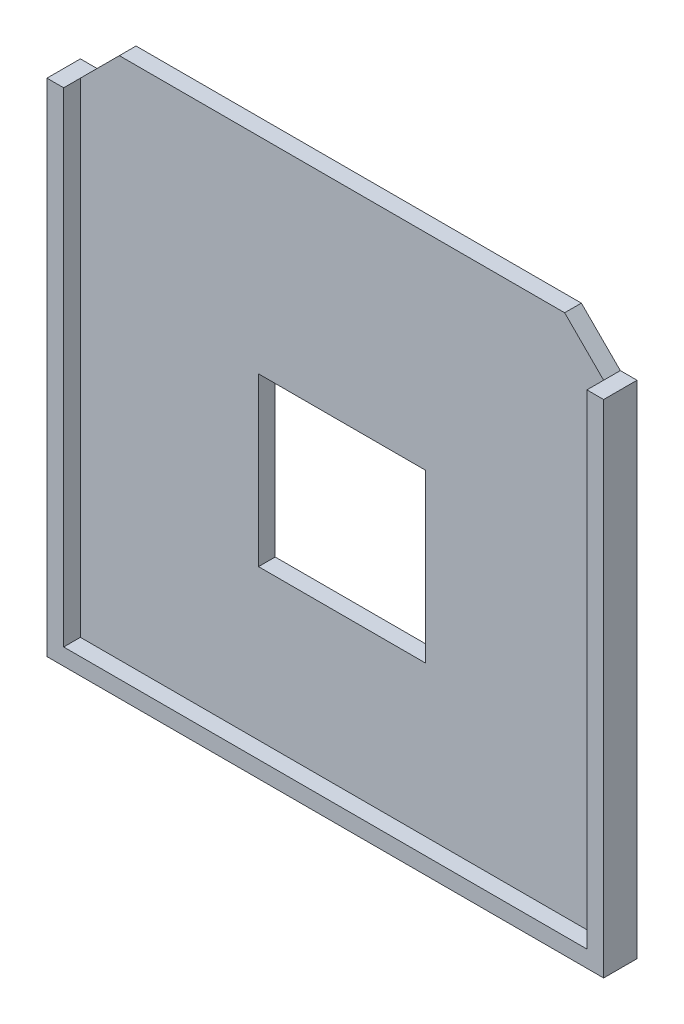
ISO-10303-21;
HEADER;
FILE_DESCRIPTION(('STEP AP214'),'2;1');
FILE_NAME('part.step','',(''),(''),'','','');
FILE_SCHEMA(('AUTOMOTIVE_DESIGN { 1 0 10303 214 1 1 1 1 }'));
ENDSEC;
DATA;
#1=APPLICATION_CONTEXT('core data for automotive mechanical design processes');
#2=APPLICATION_PROTOCOL_DEFINITION('international standard','automotive_design',2000,#1);
#3=PRODUCT_CONTEXT('',#1,'mechanical');
#4=PRODUCT('Part','Part','',(#3));
#5=PRODUCT_RELATED_PRODUCT_CATEGORY('part','',(#4));
#6=PRODUCT_DEFINITION_FORMATION('','',#4);
#7=PRODUCT_DEFINITION_CONTEXT('part definition',#1,'design');
#8=PRODUCT_DEFINITION('design','',#6,#7);
#9=PRODUCT_DEFINITION_SHAPE('','',#8);
#10=(LENGTH_UNIT() NAMED_UNIT(*) SI_UNIT(.MILLI.,.METRE.));
#11=(NAMED_UNIT(*) PLANE_ANGLE_UNIT() SI_UNIT($,.RADIAN.));
#12=(NAMED_UNIT(*) SI_UNIT($,.STERADIAN.) SOLID_ANGLE_UNIT());
#13=UNCERTAINTY_MEASURE_WITH_UNIT(LENGTH_MEASURE(1.E-05),#10,'distance_accuracy_value','');
#14=(GEOMETRIC_REPRESENTATION_CONTEXT(3) GLOBAL_UNCERTAINTY_ASSIGNED_CONTEXT((#13)) GLOBAL_UNIT_ASSIGNED_CONTEXT((#10,
#11,#12)) REPRESENTATION_CONTEXT('',''));
#15=CARTESIAN_POINT('',(0.,0.,0.));
#16=DIRECTION('',(0.,0.,1.));
#17=DIRECTION('',(1.,0.,0.));
#18=AXIS2_PLACEMENT_3D('',#15,#16,#17);
#19=CARTESIAN_POINT('',(47.,45.,3.));
#20=DIRECTION('',(0.,-1.,0.));
#21=DIRECTION('',(0.,0.,-1.));
#22=AXIS2_PLACEMENT_3D('',#19,#20,#21);
#23=PLANE('',#22);
#24=DIRECTION('',(-1.,0.,0.));
#25=VECTOR('',#24,1.);
#26=CARTESIAN_POINT('',(47.,45.,0.));
#27=LINE('',#26,#25);
#28=CARTESIAN_POINT('',(50.,45.,0.));
#29=VERTEX_POINT('',#28);
#30=CARTESIAN_POINT('',(47.,45.,0.));
#31=VERTEX_POINT('',#30);
#32=EDGE_CURVE('E252',#29,#31,#27,.T.);
#33=ORIENTED_EDGE('',*,*,#32,.T.);
#34=DIRECTION('',(0.,0.,-1.));
#35=VECTOR('',#34,1.);
#36=CARTESIAN_POINT('',(47.,45.,3.));
#37=LINE('',#36,#35);
#38=CARTESIAN_POINT('',(47.,45.,3.));
#39=VERTEX_POINT('',#38);
#40=EDGE_CURVE('E11',#39,#31,#37,.T.);
#41=ORIENTED_EDGE('',*,*,#40,.F.);
#42=DIRECTION('',(0.,0.,-1.));
#43=VECTOR('',#42,1.);
#44=CARTESIAN_POINT('',(47.,45.,6.));
#45=LINE('',#44,#43);
#46=CARTESIAN_POINT('',(47.,45.,6.));
#47=VERTEX_POINT('',#46);
#48=EDGE_CURVE('E214',#47,#39,#45,.T.);
#49=ORIENTED_EDGE('',*,*,#48,.F.);
#50=DIRECTION('',(-1.,0.,0.));
#51=VECTOR('',#50,1.);
#52=CARTESIAN_POINT('',(47.,45.,6.));
#53=LINE('',#52,#51);
#54=CARTESIAN_POINT('',(50.,45.,6.));
#55=VERTEX_POINT('',#54);
#56=EDGE_CURVE('E182',#55,#47,#53,.T.);
#57=ORIENTED_EDGE('',*,*,#56,.F.);
#58=DIRECTION('',(0.,0.,-1.));
#59=VECTOR('',#58,1.);
#60=CARTESIAN_POINT('',(50.,45.,3.));
#61=LINE('',#60,#59);
#62=EDGE_CURVE('E271',#55,#29,#61,.T.);
#63=ORIENTED_EDGE('',*,*,#62,.T.);
#64=EDGE_LOOP('',(#33,#41,#49,#57,#63));
#65=FACE_BOUND('',#64,.T.);
#66=ADVANCED_FACE('F39',(#65),#23,.F.);
#67=CARTESIAN_POINT('',(40.,52.,3.));
#68=DIRECTION('',(-0.707106781186549,-0.707106781186546,0.));
#69=DIRECTION('',(0.707106781186546,-0.707106781186549,0.));
#70=AXIS2_PLACEMENT_3D('',#67,#68,#69);
#71=PLANE('',#70);
#72=DIRECTION('',(-0.707106781186546,0.707106781186549,0.));
#73=VECTOR('',#72,1.);
#74=CARTESIAN_POINT('',(40.,52.,0.));
#75=LINE('',#74,#73);
#76=CARTESIAN_POINT('',(40.,52.,0.));
#77=VERTEX_POINT('',#76);
#78=EDGE_CURVE('E275',#31,#77,#75,.T.);
#79=ORIENTED_EDGE('',*,*,#78,.T.);
#80=DIRECTION('',(0.,0.,-1.));
#81=VECTOR('',#80,1.);
#82=CARTESIAN_POINT('',(40.,52.,3.));
#83=LINE('',#82,#81);
#84=CARTESIAN_POINT('',(40.,52.,3.));
#85=VERTEX_POINT('',#84);
#86=EDGE_CURVE('E47',#85,#77,#83,.T.);
#87=ORIENTED_EDGE('',*,*,#86,.F.);
#88=DIRECTION('',(-0.707106781186546,0.707106781186549,0.));
#89=VECTOR('',#88,1.);
#90=CARTESIAN_POINT('',(40.,52.,3.));
#91=LINE('',#90,#89);
#92=EDGE_CURVE('E261',#39,#85,#91,.T.);
#93=ORIENTED_EDGE('',*,*,#92,.F.);
#94=ORIENTED_EDGE('',*,*,#40,.T.);
#95=EDGE_LOOP('',(#79,#87,#93,#94));
#96=FACE_BOUND('',#95,.T.);
#97=ADVANCED_FACE('F347',(#96),#71,.F.);
#98=CARTESIAN_POINT('',(-40.,52.,3.));
#99=DIRECTION('',(0.,-1.,0.));
#100=DIRECTION('',(0.,0.,-1.));
#101=AXIS2_PLACEMENT_3D('',#98,#99,#100);
#102=PLANE('',#101);
#103=DIRECTION('',(-1.,0.,0.));
#104=VECTOR('',#103,1.);
#105=CARTESIAN_POINT('',(-40.,52.,0.));
#106=LINE('',#105,#104);
#107=CARTESIAN_POINT('',(-40.,52.,0.));
#108=VERTEX_POINT('',#107);
#109=EDGE_CURVE('E278',#77,#108,#106,.T.);
#110=ORIENTED_EDGE('',*,*,#109,.T.);
#111=DIRECTION('',(0.,0.,-1.));
#112=VECTOR('',#111,1.);
#113=CARTESIAN_POINT('',(-40.,52.,3.));
#114=LINE('',#113,#112);
#115=CARTESIAN_POINT('',(-40.,52.,3.));
#116=VERTEX_POINT('',#115);
#117=EDGE_CURVE('E305',#116,#108,#114,.T.);
#118=ORIENTED_EDGE('',*,*,#117,.F.);
#119=DIRECTION('',(-1.,0.,0.));
#120=VECTOR('',#119,1.);
#121=CARTESIAN_POINT('',(-40.,52.,3.));
#122=LINE('',#121,#120);
#123=EDGE_CURVE('E264',#85,#116,#122,.T.);
#124=ORIENTED_EDGE('',*,*,#123,.F.);
#125=ORIENTED_EDGE('',*,*,#86,.T.);
#126=EDGE_LOOP('',(#110,#118,#124,#125));
#127=FACE_BOUND('',#126,.T.);
#128=ADVANCED_FACE('F314',(#127),#102,.F.);
#129=CARTESIAN_POINT('',(-47.,45.,3.));
#130=DIRECTION('',(0.707106781186549,-0.707106781186546,0.));
#131=DIRECTION('',(0.707106781186546,0.707106781186549,0.));
#132=AXIS2_PLACEMENT_3D('',#129,#130,#131);
#133=PLANE('',#132);
#134=DIRECTION('',(-0.707106781186546,-0.707106781186549,0.));
#135=VECTOR('',#134,1.);
#136=CARTESIAN_POINT('',(-47.,45.,0.));
#137=LINE('',#136,#135);
#138=CARTESIAN_POINT('',(-47.,45.,0.));
#139=VERTEX_POINT('',#138);
#140=EDGE_CURVE('E281',#108,#139,#137,.T.);
#141=ORIENTED_EDGE('',*,*,#140,.T.);
#142=DIRECTION('',(0.,0.,-1.));
#143=VECTOR('',#142,1.);
#144=CARTESIAN_POINT('',(-47.,45.,3.));
#145=LINE('',#144,#143);
#146=CARTESIAN_POINT('',(-47.,45.,3.));
#147=VERTEX_POINT('',#146);
#148=EDGE_CURVE('E301',#147,#139,#145,.T.);
#149=ORIENTED_EDGE('',*,*,#148,.F.);
#150=DIRECTION('',(-0.707106781186546,-0.707106781186549,0.));
#151=VECTOR('',#150,1.);
#152=CARTESIAN_POINT('',(-47.,45.,3.));
#153=LINE('',#152,#151);
#154=EDGE_CURVE('E268',#116,#147,#153,.T.);
#155=ORIENTED_EDGE('',*,*,#154,.F.);
#156=ORIENTED_EDGE('',*,*,#117,.T.);
#157=EDGE_LOOP('',(#141,#149,#155,#156));
#158=FACE_BOUND('',#157,.T.);
#159=ADVANCED_FACE('F325',(#158),#133,.F.);
#160=CARTESIAN_POINT('',(-50.,45.,3.));
#161=DIRECTION('',(0.,-1.,0.));
#162=DIRECTION('',(0.,0.,-1.));
#163=AXIS2_PLACEMENT_3D('',#160,#161,#162);
#164=PLANE('',#163);
#165=DIRECTION('',(-1.,0.,0.));
#166=VECTOR('',#165,1.);
#167=CARTESIAN_POINT('',(-50.,45.,0.));
#168=LINE('',#167,#166);
#169=CARTESIAN_POINT('',(-50.,45.,0.));
#170=VERTEX_POINT('',#169);
#171=EDGE_CURVE('E284',#139,#170,#168,.T.);
#172=ORIENTED_EDGE('',*,*,#171,.T.);
#173=DIRECTION('',(0.,0.,-1.));
#174=VECTOR('',#173,1.);
#175=CARTESIAN_POINT('',(-50.,45.,3.));
#176=LINE('',#175,#174);
#177=CARTESIAN_POINT('',(-50.,45.,6.));
#178=VERTEX_POINT('',#177);
#179=EDGE_CURVE('E157',#178,#170,#176,.T.);
#180=ORIENTED_EDGE('',*,*,#179,.F.);
#181=DIRECTION('',(-1.,0.,0.));
#182=VECTOR('',#181,1.);
#183=CARTESIAN_POINT('',(-50.,45.,6.));
#184=LINE('',#183,#182);
#185=CARTESIAN_POINT('',(-47.,45.,6.));
#186=VERTEX_POINT('',#185);
#187=EDGE_CURVE('E173',#186,#178,#184,.T.);
#188=ORIENTED_EDGE('',*,*,#187,.F.);
#189=DIRECTION('',(0.,0.,-1.));
#190=VECTOR('',#189,1.);
#191=CARTESIAN_POINT('',(-47.,45.,6.));
#192=LINE('',#191,#190);
#193=EDGE_CURVE('E196',#186,#147,#192,.T.);
#194=ORIENTED_EDGE('',*,*,#193,.T.);
#195=ORIENTED_EDGE('',*,*,#148,.T.);
#196=EDGE_LOOP('',(#172,#180,#188,#194,#195));
#197=FACE_BOUND('',#196,.T.);
#198=ADVANCED_FACE('F328',(#197),#164,.F.);
#199=CARTESIAN_POINT('',(-50.,-45.,3.));
#200=DIRECTION('',(1.,0.,0.));
#201=DIRECTION('',(0.,0.,-1.));
#202=AXIS2_PLACEMENT_3D('',#199,#200,#201);
#203=PLANE('',#202);
#204=DIRECTION('',(0.,-1.,0.));
#205=VECTOR('',#204,1.);
#206=CARTESIAN_POINT('',(-50.,-45.,0.));
#207=LINE('',#206,#205);
#208=CARTESIAN_POINT('',(-50.,-45.,0.));
#209=VERTEX_POINT('',#208);
#210=EDGE_CURVE('E153',#170,#209,#207,.T.);
#211=ORIENTED_EDGE('',*,*,#210,.T.);
#212=DIRECTION('',(0.,0.,-1.));
#213=VECTOR('',#212,1.);
#214=CARTESIAN_POINT('',(-50.,-45.,3.));
#215=LINE('',#214,#213);
#216=CARTESIAN_POINT('',(-50.,-45.,6.));
#217=VERTEX_POINT('',#216);
#218=EDGE_CURVE('E146',#217,#209,#215,.T.);
#219=ORIENTED_EDGE('',*,*,#218,.F.);
#220=DIRECTION('',(0.,-1.,0.));
#221=VECTOR('',#220,1.);
#222=CARTESIAN_POINT('',(-50.,-45.,6.));
#223=LINE('',#222,#221);
#224=EDGE_CURVE('E151',#178,#217,#223,.T.);
#225=ORIENTED_EDGE('',*,*,#224,.F.);
#226=ORIENTED_EDGE('',*,*,#179,.T.);
#227=EDGE_LOOP('',(#211,#219,#225,#226));
#228=FACE_BOUND('',#227,.T.);
#229=ADVANCED_FACE('F148',(#228),#203,.F.);
#230=CARTESIAN_POINT('',(-50.,-45.,3.));
#231=DIRECTION('',(0.,1.,0.));
#232=DIRECTION('',(0.,0.,1.));
#233=AXIS2_PLACEMENT_3D('',#230,#231,#232);
#234=PLANE('',#233);
#235=DIRECTION('',(1.,0.,0.));
#236=VECTOR('',#235,1.);
#237=CARTESIAN_POINT('',(-50.,-45.,0.));
#238=LINE('',#237,#236);
#239=CARTESIAN_POINT('',(50.,-45.,0.));
#240=VERTEX_POINT('',#239);
#241=EDGE_CURVE('E289',#209,#240,#238,.T.);
#242=ORIENTED_EDGE('',*,*,#241,.T.);
#243=DIRECTION('',(0.,0.,-1.));
#244=VECTOR('',#243,1.);
#245=CARTESIAN_POINT('',(50.,-45.,3.));
#246=LINE('',#245,#244);
#247=CARTESIAN_POINT('',(50.,-45.,6.));
#248=VERTEX_POINT('',#247);
#249=EDGE_CURVE('E158',#248,#240,#246,.T.);
#250=ORIENTED_EDGE('',*,*,#249,.F.);
#251=DIRECTION('',(1.,0.,0.));
#252=VECTOR('',#251,1.);
#253=CARTESIAN_POINT('',(50.,-45.,6.));
#254=LINE('',#253,#252);
#255=EDGE_CURVE('E161',#217,#248,#254,.T.);
#256=ORIENTED_EDGE('',*,*,#255,.F.);
#257=ORIENTED_EDGE('',*,*,#218,.T.);
#258=EDGE_LOOP('',(#242,#250,#256,#257));
#259=FACE_BOUND('',#258,.T.);
#260=ADVANCED_FACE('F162',(#259),#234,.F.);
#261=CARTESIAN_POINT('',(50.,-45.,3.));
#262=DIRECTION('',(-1.,0.,0.));
#263=DIRECTION('',(0.,0.,1.));
#264=AXIS2_PLACEMENT_3D('',#261,#262,#263);
#265=PLANE('',#264);
#266=DIRECTION('',(0.,1.,0.));
#267=VECTOR('',#266,1.);
#268=CARTESIAN_POINT('',(50.,-45.,0.));
#269=LINE('',#268,#267);
#270=EDGE_CURVE('E265',#240,#29,#269,.T.);
#271=ORIENTED_EDGE('',*,*,#270,.T.);
#272=ORIENTED_EDGE('',*,*,#62,.F.);
#273=DIRECTION('',(0.,1.,0.));
#274=VECTOR('',#273,1.);
#275=CARTESIAN_POINT('',(50.,45.,6.));
#276=LINE('',#275,#274);
#277=EDGE_CURVE('E168',#248,#55,#276,.T.);
#278=ORIENTED_EDGE('',*,*,#277,.F.);
#279=ORIENTED_EDGE('',*,*,#249,.T.);
#280=EDGE_LOOP('',(#271,#272,#278,#279));
#281=FACE_BOUND('',#280,.T.);
#282=ADVANCED_FACE('F363',(#281),#265,.F.);
#283=CARTESIAN_POINT('',(0.,0.,3.));
#284=DIRECTION('',(0.,0.,1.));
#285=DIRECTION('',(1.,0.,0.));
#286=AXIS2_PLACEMENT_3D('',#283,#284,#285);
#287=PLANE('',#286);
#288=DIRECTION('',(0.,1.,0.));
#289=VECTOR('',#288,1.);
#290=CARTESIAN_POINT('',(-47.,45.,3.));
#291=LINE('',#290,#289);
#292=CARTESIAN_POINT('',(-47.,-42.,3.));
#293=VERTEX_POINT('',#292);
#294=EDGE_CURVE('E54',#293,#147,#291,.T.);
#295=ORIENTED_EDGE('',*,*,#294,.F.);
#296=DIRECTION('',(-1.,0.,0.));
#297=VECTOR('',#296,1.);
#298=CARTESIAN_POINT('',(-47.,-42.,3.));
#299=LINE('',#298,#297);
#300=CARTESIAN_POINT('',(47.,-42.,3.));
#301=VERTEX_POINT('',#300);
#302=EDGE_CURVE('E177',#301,#293,#299,.T.);
#303=ORIENTED_EDGE('',*,*,#302,.F.);
#304=DIRECTION('',(0.,-1.,0.));
#305=VECTOR('',#304,1.);
#306=CARTESIAN_POINT('',(47.,-42.,3.));
#307=LINE('',#306,#305);
#308=EDGE_CURVE('E197',#39,#301,#307,.T.);
#309=ORIENTED_EDGE('',*,*,#308,.F.);
#310=ORIENTED_EDGE('',*,*,#92,.T.);
#311=ORIENTED_EDGE('',*,*,#123,.T.);
#312=ORIENTED_EDGE('',*,*,#154,.T.);
#313=EDGE_LOOP('',(#295,#303,#309,#310,#311,#312));
#314=FACE_BOUND('',#313,.T.);
#315=DIRECTION('',(0.,1.,0.));
#316=VECTOR('',#315,1.);
#317=CARTESIAN_POINT('',(15.,-15.,3.));
#318=LINE('',#317,#316);
#319=CARTESIAN_POINT('',(15.,-15.,3.));
#320=VERTEX_POINT('',#319);
#321=CARTESIAN_POINT('',(15.,15.,3.));
#322=VERTEX_POINT('',#321);
#323=EDGE_CURVE('E62',#320,#322,#318,.T.);
#324=ORIENTED_EDGE('',*,*,#323,.F.);
#325=DIRECTION('',(1.,0.,0.));
#326=VECTOR('',#325,1.);
#327=CARTESIAN_POINT('',(-15.,-15.,3.));
#328=LINE('',#327,#326);
#329=CARTESIAN_POINT('',(-15.,-15.,3.));
#330=VERTEX_POINT('',#329);
#331=EDGE_CURVE('E223',#330,#320,#328,.T.);
#332=ORIENTED_EDGE('',*,*,#331,.F.);
#333=DIRECTION('',(0.,-1.,0.));
#334=VECTOR('',#333,1.);
#335=CARTESIAN_POINT('',(-15.,-15.,3.));
#336=LINE('',#335,#334);
#337=CARTESIAN_POINT('',(-15.,15.,3.));
#338=VERTEX_POINT('',#337);
#339=EDGE_CURVE('E242',#338,#330,#336,.T.);
#340=ORIENTED_EDGE('',*,*,#339,.F.);
#341=DIRECTION('',(-1.,0.,0.));
#342=VECTOR('',#341,1.);
#343=CARTESIAN_POINT('',(-15.,15.,3.));
#344=LINE('',#343,#342);
#345=EDGE_CURVE('E238',#322,#338,#344,.T.);
#346=ORIENTED_EDGE('',*,*,#345,.F.);
#347=EDGE_LOOP('',(#324,#332,#340,#346));
#348=FACE_BOUND('',#347,.T.);
#349=ADVANCED_FACE('F338',(#314,#348),#287,.T.);
#350=CARTESIAN_POINT('',(0.,0.,0.));
#351=DIRECTION('',(0.,0.,1.));
#352=DIRECTION('',(1.,0.,0.));
#353=AXIS2_PLACEMENT_3D('',#350,#351,#352);
#354=PLANE('',#353);
#355=DIRECTION('',(1.,0.,0.));
#356=VECTOR('',#355,1.);
#357=CARTESIAN_POINT('',(-15.,-15.,0.));
#358=LINE('',#357,#356);
#359=CARTESIAN_POINT('',(-15.,-15.,0.));
#360=VERTEX_POINT('',#359);
#361=CARTESIAN_POINT('',(15.,-15.,0.));
#362=VERTEX_POINT('',#361);
#363=EDGE_CURVE('E231',#360,#362,#358,.T.);
#364=ORIENTED_EDGE('',*,*,#363,.T.);
#365=DIRECTION('',(0.,1.,0.));
#366=VECTOR('',#365,1.);
#367=CARTESIAN_POINT('',(15.,-15.,0.));
#368=LINE('',#367,#366);
#369=CARTESIAN_POINT('',(15.,15.,0.));
#370=VERTEX_POINT('',#369);
#371=EDGE_CURVE('E218',#362,#370,#368,.T.);
#372=ORIENTED_EDGE('',*,*,#371,.T.);
#373=DIRECTION('',(-1.,0.,0.));
#374=VECTOR('',#373,1.);
#375=CARTESIAN_POINT('',(-15.,15.,0.));
#376=LINE('',#375,#374);
#377=CARTESIAN_POINT('',(-15.,15.,0.));
#378=VERTEX_POINT('',#377);
#379=EDGE_CURVE('E222',#370,#378,#376,.T.);
#380=ORIENTED_EDGE('',*,*,#379,.T.);
#381=DIRECTION('',(0.,-1.,0.));
#382=VECTOR('',#381,1.);
#383=CARTESIAN_POINT('',(-15.,-15.,0.));
#384=LINE('',#383,#382);
#385=EDGE_CURVE('E227',#378,#360,#384,.T.);
#386=ORIENTED_EDGE('',*,*,#385,.T.);
#387=EDGE_LOOP('',(#364,#372,#380,#386));
#388=FACE_BOUND('',#387,.T.);
#389=ORIENTED_EDGE('',*,*,#32,.F.);
#390=ORIENTED_EDGE('',*,*,#270,.F.);
#391=ORIENTED_EDGE('',*,*,#241,.F.);
#392=ORIENTED_EDGE('',*,*,#210,.F.);
#393=ORIENTED_EDGE('',*,*,#171,.F.);
#394=ORIENTED_EDGE('',*,*,#140,.F.);
#395=ORIENTED_EDGE('',*,*,#109,.F.);
#396=ORIENTED_EDGE('',*,*,#78,.F.);
#397=EDGE_LOOP('',(#389,#390,#391,#392,#393,#394,#395,#396));
#398=FACE_BOUND('',#397,.T.);
#399=ADVANCED_FACE('F321',(#388,#398),#354,.F.);
#400=CARTESIAN_POINT('',(15.,-15.,0.));
#401=DIRECTION('',(1.,0.,0.));
#402=DIRECTION('',(0.,0.,-1.));
#403=AXIS2_PLACEMENT_3D('',#400,#401,#402);
#404=PLANE('',#403);
#405=ORIENTED_EDGE('',*,*,#323,.T.);
#406=DIRECTION('',(0.,0.,1.));
#407=VECTOR('',#406,1.);
#408=CARTESIAN_POINT('',(15.,15.,0.));
#409=LINE('',#408,#407);
#410=EDGE_CURVE('E235',#370,#322,#409,.T.);
#411=ORIENTED_EDGE('',*,*,#410,.F.);
#412=ORIENTED_EDGE('',*,*,#371,.F.);
#413=DIRECTION('',(0.,0.,1.));
#414=VECTOR('',#413,1.);
#415=CARTESIAN_POINT('',(15.,-15.,0.));
#416=LINE('',#415,#414);
#417=EDGE_CURVE('E249',#362,#320,#416,.T.);
#418=ORIENTED_EDGE('',*,*,#417,.T.);
#419=EDGE_LOOP('',(#405,#411,#412,#418));
#420=FACE_BOUND('',#419,.T.);
#421=ADVANCED_FACE('F369',(#420),#404,.F.);
#422=CARTESIAN_POINT('',(-15.,-15.,0.));
#423=DIRECTION('',(0.,-1.,0.));
#424=DIRECTION('',(0.,0.,-1.));
#425=AXIS2_PLACEMENT_3D('',#422,#423,#424);
#426=PLANE('',#425);
#427=ORIENTED_EDGE('',*,*,#331,.T.);
#428=ORIENTED_EDGE('',*,*,#417,.F.);
#429=ORIENTED_EDGE('',*,*,#363,.F.);
#430=DIRECTION('',(0.,0.,1.));
#431=VECTOR('',#430,1.);
#432=CARTESIAN_POINT('',(-15.,-15.,0.));
#433=LINE('',#432,#431);
#434=EDGE_CURVE('E253',#360,#330,#433,.T.);
#435=ORIENTED_EDGE('',*,*,#434,.T.);
#436=EDGE_LOOP('',(#427,#428,#429,#435));
#437=FACE_BOUND('',#436,.T.);
#438=ADVANCED_FACE('F375',(#437),#426,.F.);
#439=CARTESIAN_POINT('',(-15.,-15.,0.));
#440=DIRECTION('',(-1.,0.,0.));
#441=DIRECTION('',(0.,0.,1.));
#442=AXIS2_PLACEMENT_3D('',#439,#440,#441);
#443=PLANE('',#442);
#444=ORIENTED_EDGE('',*,*,#339,.T.);
#445=ORIENTED_EDGE('',*,*,#434,.F.);
#446=ORIENTED_EDGE('',*,*,#385,.F.);
#447=DIRECTION('',(0.,0.,1.));
#448=VECTOR('',#447,1.);
#449=CARTESIAN_POINT('',(-15.,15.,0.));
#450=LINE('',#449,#448);
#451=EDGE_CURVE('E256',#378,#338,#450,.T.);
#452=ORIENTED_EDGE('',*,*,#451,.T.);
#453=EDGE_LOOP('',(#444,#445,#446,#452));
#454=FACE_BOUND('',#453,.T.);
#455=ADVANCED_FACE('F379',(#454),#443,.F.);
#456=CARTESIAN_POINT('',(-15.,15.,0.));
#457=DIRECTION('',(0.,1.,0.));
#458=DIRECTION('',(0.,0.,1.));
#459=AXIS2_PLACEMENT_3D('',#456,#457,#458);
#460=PLANE('',#459);
#461=ORIENTED_EDGE('',*,*,#345,.T.);
#462=ORIENTED_EDGE('',*,*,#451,.F.);
#463=ORIENTED_EDGE('',*,*,#379,.F.);
#464=ORIENTED_EDGE('',*,*,#410,.T.);
#465=EDGE_LOOP('',(#461,#462,#463,#464));
#466=FACE_BOUND('',#465,.T.);
#467=ADVANCED_FACE('F376',(#466),#460,.F.);
#468=CARTESIAN_POINT('',(47.,-42.,6.));
#469=DIRECTION('',(1.,0.,0.));
#470=DIRECTION('',(0.,0.,-1.));
#471=AXIS2_PLACEMENT_3D('',#468,#469,#470);
#472=PLANE('',#471);
#473=ORIENTED_EDGE('',*,*,#308,.T.);
#474=DIRECTION('',(0.,0.,-1.));
#475=VECTOR('',#474,1.);
#476=CARTESIAN_POINT('',(47.,-42.,6.));
#477=LINE('',#476,#475);
#478=CARTESIAN_POINT('',(47.,-42.,6.));
#479=VERTEX_POINT('',#478);
#480=EDGE_CURVE('E210',#479,#301,#477,.T.);
#481=ORIENTED_EDGE('',*,*,#480,.F.);
#482=DIRECTION('',(0.,-1.,0.));
#483=VECTOR('',#482,1.);
#484=CARTESIAN_POINT('',(47.,-42.,6.));
#485=LINE('',#484,#483);
#486=EDGE_CURVE('E185',#47,#479,#485,.T.);
#487=ORIENTED_EDGE('',*,*,#486,.F.);
#488=ORIENTED_EDGE('',*,*,#48,.T.);
#489=EDGE_LOOP('',(#473,#481,#487,#488));
#490=FACE_BOUND('',#489,.T.);
#491=ADVANCED_FACE('F341',(#490),#472,.F.);
#492=CARTESIAN_POINT('',(-47.,-42.,6.));
#493=DIRECTION('',(0.,-1.,0.));
#494=DIRECTION('',(0.,0.,-1.));
#495=AXIS2_PLACEMENT_3D('',#492,#493,#494);
#496=PLANE('',#495);
#497=ORIENTED_EDGE('',*,*,#302,.T.);
#498=DIRECTION('',(0.,0.,-1.));
#499=VECTOR('',#498,1.);
#500=CARTESIAN_POINT('',(-47.,-42.,6.));
#501=LINE('',#500,#499);
#502=CARTESIAN_POINT('',(-47.,-42.,6.));
#503=VERTEX_POINT('',#502);
#504=EDGE_CURVE('E206',#503,#293,#501,.T.);
#505=ORIENTED_EDGE('',*,*,#504,.F.);
#506=DIRECTION('',(-1.,0.,0.));
#507=VECTOR('',#506,1.);
#508=CARTESIAN_POINT('',(-47.,-42.,6.));
#509=LINE('',#508,#507);
#510=EDGE_CURVE('E188',#479,#503,#509,.T.);
#511=ORIENTED_EDGE('',*,*,#510,.F.);
#512=ORIENTED_EDGE('',*,*,#480,.T.);
#513=EDGE_LOOP('',(#497,#505,#511,#512));
#514=FACE_BOUND('',#513,.T.);
#515=ADVANCED_FACE('F336',(#514),#496,.F.);
#516=CARTESIAN_POINT('',(-47.,45.,6.));
#517=DIRECTION('',(-1.,0.,0.));
#518=DIRECTION('',(0.,-1.,0.));
#519=AXIS2_PLACEMENT_3D('',#516,#517,#518);
#520=PLANE('',#519);
#521=ORIENTED_EDGE('',*,*,#294,.T.);
#522=ORIENTED_EDGE('',*,*,#193,.F.);
#523=DIRECTION('',(0.,1.,0.));
#524=VECTOR('',#523,1.);
#525=CARTESIAN_POINT('',(-47.,45.,6.));
#526=LINE('',#525,#524);
#527=EDGE_CURVE('E191',#503,#186,#526,.T.);
#528=ORIENTED_EDGE('',*,*,#527,.F.);
#529=ORIENTED_EDGE('',*,*,#504,.T.);
#530=EDGE_LOOP('',(#521,#522,#528,#529));
#531=FACE_BOUND('',#530,.T.);
#532=ADVANCED_FACE('F332',(#531),#520,.F.);
#533=CARTESIAN_POINT('',(0.,0.,6.));
#534=DIRECTION('',(0.,0.,-1.));
#535=DIRECTION('',(-1.,0.,0.));
#536=AXIS2_PLACEMENT_3D('',#533,#534,#535);
#537=PLANE('',#536);
#538=ORIENTED_EDGE('',*,*,#224,.T.);
#539=ORIENTED_EDGE('',*,*,#255,.T.);
#540=ORIENTED_EDGE('',*,*,#277,.T.);
#541=ORIENTED_EDGE('',*,*,#56,.T.);
#542=ORIENTED_EDGE('',*,*,#486,.T.);
#543=ORIENTED_EDGE('',*,*,#510,.T.);
#544=ORIENTED_EDGE('',*,*,#527,.T.);
#545=ORIENTED_EDGE('',*,*,#187,.T.);
#546=EDGE_LOOP('',(#538,#539,#540,#541,#542,#543,#544,#545));
#547=FACE_BOUND('',#546,.T.);
#548=ADVANCED_FACE('F171',(#547),#537,.F.);
#549=CLOSED_SHELL('',(#66,#97,#128,#159,#198,#229,#260,#282,#349,#399,#421,#438,#455,#467,#491,
#515,#532,#548));
#550=MANIFOLD_SOLID_BREP('B2',#549);
#551=ADVANCED_BREP_SHAPE_REPRESENTATION('',(#18,#550),#14);
#552=SHAPE_DEFINITION_REPRESENTATION(#9,#551);
ENDSEC;
END-ISO-10303-21;
